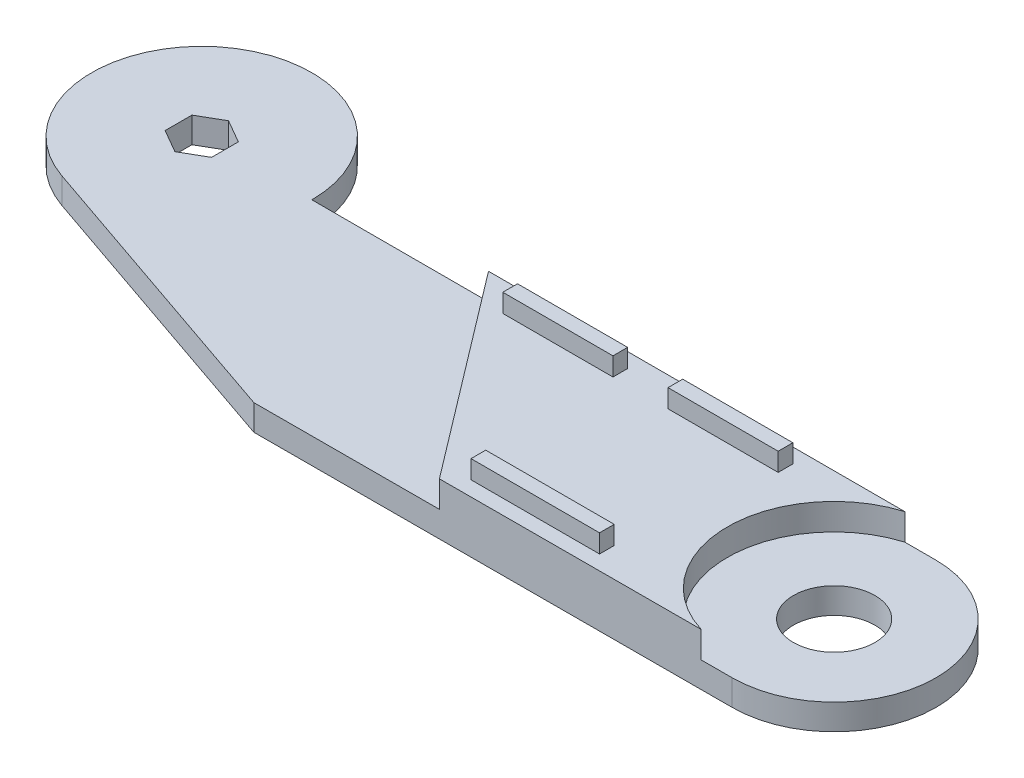
ISO-10303-21;
HEADER;
FILE_DESCRIPTION(('STEP AP214'),'2;1');
FILE_NAME('part.step','',(''),(''),'','','');
FILE_SCHEMA(('AUTOMOTIVE_DESIGN { 1 0 10303 214 1 1 1 1 }'));
ENDSEC;
DATA;
#1=APPLICATION_CONTEXT('core data for automotive mechanical design processes');
#2=APPLICATION_PROTOCOL_DEFINITION('international standard','automotive_design',2000,#1);
#3=PRODUCT_CONTEXT('',#1,'mechanical');
#4=PRODUCT('Part','Part','',(#3));
#5=PRODUCT_RELATED_PRODUCT_CATEGORY('part','',(#4));
#6=PRODUCT_DEFINITION_FORMATION('','',#4);
#7=PRODUCT_DEFINITION_CONTEXT('part definition',#1,'design');
#8=PRODUCT_DEFINITION('design','',#6,#7);
#9=PRODUCT_DEFINITION_SHAPE('','',#8);
#10=(LENGTH_UNIT() NAMED_UNIT(*) SI_UNIT(.MILLI.,.METRE.));
#11=(NAMED_UNIT(*) PLANE_ANGLE_UNIT() SI_UNIT($,.RADIAN.));
#12=(NAMED_UNIT(*) SI_UNIT($,.STERADIAN.) SOLID_ANGLE_UNIT());
#13=UNCERTAINTY_MEASURE_WITH_UNIT(LENGTH_MEASURE(1.E-05),#10,'distance_accuracy_value','');
#14=(GEOMETRIC_REPRESENTATION_CONTEXT(3) GLOBAL_UNCERTAINTY_ASSIGNED_CONTEXT((#13)) GLOBAL_UNIT_ASSIGNED_CONTEXT((#10,
#11,#12)) REPRESENTATION_CONTEXT('',''));
#15=CARTESIAN_POINT('',(0.,0.,0.));
#16=DIRECTION('',(0.,0.,1.));
#17=DIRECTION('',(1.,0.,0.));
#18=AXIS2_PLACEMENT_3D('',#15,#16,#17);
#19=CARTESIAN_POINT('',(0.,14.2,0.));
#20=DIRECTION('',(0.,1.,0.));
#21=DIRECTION('',(0.,0.,1.));
#22=AXIS2_PLACEMENT_3D('',#19,#20,#21);
#23=PLANE('',#22);
#24=DIRECTION('',(-0.604935888817992,0.,-0.796274180430325));
#25=VECTOR('',#24,1.);
#26=CARTESIAN_POINT('',(78.1003968083203,14.2,0.));
#27=LINE('',#26,#25);
#28=CARTESIAN_POINT('',(120.375042432172,14.2,55.6459112764647));
#29=VERTEX_POINT('',#28);
#30=CARTESIAN_POINT('',(78.1003968083203,14.2,0.));
#31=VERTEX_POINT('',#30);
#32=EDGE_CURVE('E240',#29,#31,#27,.T.);
#33=ORIENTED_EDGE('',*,*,#32,.F.);
#34=DIRECTION('',(0.999998314733049,0.,-0.0018359006134582));
#35=VECTOR('',#34,1.);
#36=CARTESIAN_POINT('',(0.102565918301086,14.2,55.8667199620002));
#37=LINE('',#36,#35);
#38=CARTESIAN_POINT('',(191.546705265924,14.2,55.5152469568031));
#39=VERTEX_POINT('',#38);
#40=EDGE_CURVE('E345',#29,#39,#37,.T.);
#41=ORIENTED_EDGE('',*,*,#40,.T.);
#42=CARTESIAN_POINT('',(199.918541878515,14.2,27.749938535464));
#43=DIRECTION('',(0.,1.,0.));
#44=DIRECTION('',(0.,0.,1.));
#45=AXIS2_PLACEMENT_3D('',#42,#43,#44);
#46=CIRCLE('',#45,29.);
#47=CARTESIAN_POINT('',(191.495899105729,14.2,0.));
#48=VERTEX_POINT('',#47);
#49=EDGE_CURVE('E340',#48,#39,#46,.T.);
#50=ORIENTED_EDGE('',*,*,#49,.F.);
#51=DIRECTION('',(-1.,0.,0.));
#52=VECTOR('',#51,1.);
#53=CARTESIAN_POINT('',(0.,14.2,0.));
#54=LINE('',#53,#52);
#55=EDGE_CURVE('E343',#48,#31,#54,.T.);
#56=ORIENTED_EDGE('',*,*,#55,.T.);
#57=EDGE_LOOP('',(#33,#41,#50,#56));
#58=FACE_BOUND('',#57,.T.);
#59=DIRECTION('',(1.,0.,0.));
#60=VECTOR('',#59,1.);
#61=CARTESIAN_POINT('',(90.,14.2,8.));
#62=LINE('',#61,#60);
#63=CARTESIAN_POINT('',(90.,14.2,8.));
#64=VERTEX_POINT('',#63);
#65=CARTESIAN_POINT('',(120.,14.2,8.));
#66=VERTEX_POINT('',#65);
#67=EDGE_CURVE('E318',#64,#66,#62,.T.);
#68=ORIENTED_EDGE('',*,*,#67,.F.);
#69=DIRECTION('',(0.,0.,1.));
#70=VECTOR('',#69,1.);
#71=CARTESIAN_POINT('',(90.,14.2,4.));
#72=LINE('',#71,#70);
#73=CARTESIAN_POINT('',(90.,14.2,4.));
#74=VERTEX_POINT('',#73);
#75=EDGE_CURVE('E304',#74,#64,#72,.T.);
#76=ORIENTED_EDGE('',*,*,#75,.F.);
#77=DIRECTION('',(-1.,0.,0.));
#78=VECTOR('',#77,1.);
#79=CARTESIAN_POINT('',(90.,14.2,4.));
#80=LINE('',#79,#78);
#81=CARTESIAN_POINT('',(120.,14.2,4.));
#82=VERTEX_POINT('',#81);
#83=EDGE_CURVE('E309',#82,#74,#80,.T.);
#84=ORIENTED_EDGE('',*,*,#83,.F.);
#85=DIRECTION('',(0.,0.,-1.));
#86=VECTOR('',#85,1.);
#87=CARTESIAN_POINT('',(120.,14.2,4.));
#88=LINE('',#87,#86);
#89=EDGE_CURVE('E320',#66,#82,#88,.T.);
#90=ORIENTED_EDGE('',*,*,#89,.F.);
#91=EDGE_LOOP('',(#68,#76,#84,#90));
#92=FACE_BOUND('',#91,.T.);
#93=DIRECTION('',(1.,0.,0.));
#94=VECTOR('',#93,1.);
#95=CARTESIAN_POINT('',(135.,14.2,8.00000000000002));
#96=LINE('',#95,#94);
#97=CARTESIAN_POINT('',(135.,14.2,8.00000000000002));
#98=VERTEX_POINT('',#97);
#99=CARTESIAN_POINT('',(165.,14.2,8.00000000000002));
#100=VERTEX_POINT('',#99);
#101=EDGE_CURVE('E291',#98,#100,#96,.T.);
#102=ORIENTED_EDGE('',*,*,#101,.F.);
#103=DIRECTION('',(0.,0.,1.));
#104=VECTOR('',#103,1.);
#105=CARTESIAN_POINT('',(135.,14.2,3.99999999999998));
#106=LINE('',#105,#104);
#107=CARTESIAN_POINT('',(135.,14.2,3.99999999999998));
#108=VERTEX_POINT('',#107);
#109=EDGE_CURVE('E277',#108,#98,#106,.T.);
#110=ORIENTED_EDGE('',*,*,#109,.F.);
#111=DIRECTION('',(-1.,0.,0.));
#112=VECTOR('',#111,1.);
#113=CARTESIAN_POINT('',(135.,14.2,3.99999999999998));
#114=LINE('',#113,#112);
#115=CARTESIAN_POINT('',(165.,14.2,3.99999999999998));
#116=VERTEX_POINT('',#115);
#117=EDGE_CURVE('E282',#116,#108,#114,.T.);
#118=ORIENTED_EDGE('',*,*,#117,.F.);
#119=DIRECTION('',(0.,0.,-1.));
#120=VECTOR('',#119,1.);
#121=CARTESIAN_POINT('',(165.,14.2,3.99999999999998));
#122=LINE('',#121,#120);
#123=EDGE_CURVE('E293',#100,#116,#122,.T.);
#124=ORIENTED_EDGE('',*,*,#123,.F.);
#125=EDGE_LOOP('',(#102,#110,#118,#124));
#126=FACE_BOUND('',#125,.T.);
#127=DIRECTION('',(1.,0.,0.));
#128=VECTOR('',#127,1.);
#129=CARTESIAN_POINT('',(124.92,14.2,51.573303801176));
#130=LINE('',#129,#128);
#131=CARTESIAN_POINT('',(124.92,14.2,51.573303801176));
#132=VERTEX_POINT('',#131);
#133=CARTESIAN_POINT('',(159.92,14.2,51.573303801176));
#134=VERTEX_POINT('',#133);
#135=EDGE_CURVE('E264',#132,#134,#130,.T.);
#136=ORIENTED_EDGE('',*,*,#135,.F.);
#137=DIRECTION('',(0.,0.,1.));
#138=VECTOR('',#137,1.);
#139=CARTESIAN_POINT('',(124.92,14.2,47.573303801176));
#140=LINE('',#139,#138);
#141=CARTESIAN_POINT('',(124.92,14.2,47.573303801176));
#142=VERTEX_POINT('',#141);
#143=EDGE_CURVE('E249',#142,#132,#140,.T.);
#144=ORIENTED_EDGE('',*,*,#143,.F.);
#145=DIRECTION('',(-1.,0.,0.));
#146=VECTOR('',#145,1.);
#147=CARTESIAN_POINT('',(124.92,14.2,47.573303801176));
#148=LINE('',#147,#146);
#149=CARTESIAN_POINT('',(159.92,14.2,47.573303801176));
#150=VERTEX_POINT('',#149);
#151=EDGE_CURVE('E255',#150,#142,#148,.T.);
#152=ORIENTED_EDGE('',*,*,#151,.F.);
#153=DIRECTION('',(0.,0.,-1.));
#154=VECTOR('',#153,1.);
#155=CARTESIAN_POINT('',(159.92,14.2,47.573303801176));
#156=LINE('',#155,#154);
#157=EDGE_CURVE('E266',#134,#150,#156,.T.);
#158=ORIENTED_EDGE('',*,*,#157,.F.);
#159=EDGE_LOOP('',(#136,#144,#152,#158));
#160=FACE_BOUND('',#159,.T.);
#161=ADVANCED_FACE('F35',(#58,#92,#126,#160),#23,.T.);
#162=CARTESIAN_POINT('',(0.,7.,0.));
#163=DIRECTION('',(0.,1.,0.));
#164=DIRECTION('',(0.,0.,1.));
#165=AXIS2_PLACEMENT_3D('',#162,#163,#164);
#166=PLANE('',#165);
#167=CARTESIAN_POINT('',(200.,7.,27.75));
#168=DIRECTION('',(0.,1.,0.));
#169=DIRECTION('',(0.,0.,1.));
#170=AXIS2_PLACEMENT_3D('',#167,#168,#169);
#171=CIRCLE('',#170,11.1);
#172=CARTESIAN_POINT('',(200.,7.,38.85));
#173=VERTEX_POINT('',#172);
#174=EDGE_CURVE('E336',#173,#173,#171,.T.);
#175=ORIENTED_EDGE('',*,*,#174,.F.);
#176=EDGE_LOOP('',(#175));
#177=FACE_BOUND('',#176,.T.);
#178=DIRECTION('',(-1.,0.,0.));
#179=VECTOR('',#178,1.);
#180=CARTESIAN_POINT('',(0.,7.,0.));
#181=LINE('',#180,#179);
#182=CARTESIAN_POINT('',(199.917837119483,7.,0.));
#183=VERTEX_POINT('',#182);
#184=CARTESIAN_POINT('',(191.495899105729,7.,0.));
#185=VERTEX_POINT('',#184);
#186=EDGE_CURVE('E231',#183,#185,#181,.T.);
#187=ORIENTED_EDGE('',*,*,#186,.T.);
#188=CARTESIAN_POINT('',(199.918541878515,7.,27.749938535464));
#189=DIRECTION('',(0.,1.,0.));
#190=DIRECTION('',(0.,0.,1.));
#191=AXIS2_PLACEMENT_3D('',#188,#189,#190);
#192=CIRCLE('',#191,29.);
#193=CARTESIAN_POINT('',(191.546705265924,7.,55.5152469568031));
#194=VERTEX_POINT('',#193);
#195=EDGE_CURVE('E339',#185,#194,#192,.T.);
#196=ORIENTED_EDGE('',*,*,#195,.T.);
#197=DIRECTION('',(-0.999998314733049,0.,0.0018359006134582));
#198=VECTOR('',#197,1.);
#199=CARTESIAN_POINT('',(0.102565918301086,7.,55.8667199620002));
#200=LINE('',#199,#198);
#201=CARTESIAN_POINT('',(199.917837119483,7.,55.4998783647976));
#202=VERTEX_POINT('',#201);
#203=EDGE_CURVE('E403',#202,#194,#200,.T.);
#204=ORIENTED_EDGE('',*,*,#203,.F.);
#205=CARTESIAN_POINT('',(200.,7.,27.75));
#206=DIRECTION('',(0.,1.,0.));
#207=DIRECTION('',(0.,0.,1.));
#208=AXIS2_PLACEMENT_3D('',#205,#206,#207);
#209=CIRCLE('',#208,27.75);
#210=CARTESIAN_POINT('',(199.917837119483,7.,0.000121635202365161));
#211=VERTEX_POINT('',#210);
#212=EDGE_CURVE('E406',#211,#202,#209,.F.);
#213=ORIENTED_EDGE('',*,*,#212,.F.);
#214=DIRECTION('',(0.,0.,-1.));
#215=VECTOR('',#214,1.);
#216=CARTESIAN_POINT('',(199.917837119483,7.,0.));
#217=LINE('',#216,#215);
#218=EDGE_CURVE('E409',#211,#183,#217,.T.);
#219=ORIENTED_EDGE('',*,*,#218,.T.);
#220=EDGE_LOOP('',(#187,#196,#204,#213,#219));
#221=FACE_BOUND('',#220,.T.);
#222=ADVANCED_FACE('F459',(#177,#221),#166,.T.);
#223=DIRECTION('',(0.866025403784439,0.,-0.5));
#224=VECTOR('',#223,1.);
#225=CARTESIAN_POINT('',(3.1609927238132,7.,5.475));
#226=LINE('',#225,#224);
#227=CARTESIAN_POINT('',(0.,7.,7.3));
#228=VERTEX_POINT('',#227);
#229=CARTESIAN_POINT('',(6.3219854476264,7.,3.65));
#230=VERTEX_POINT('',#229);
#231=EDGE_CURVE('E394',#228,#230,#226,.T.);
#232=ORIENTED_EDGE('',*,*,#231,.F.);
#233=DIRECTION('',(0.866025403784439,0.,0.5));
#234=VECTOR('',#233,1.);
#235=CARTESIAN_POINT('',(-3.1609927238132,7.,5.475));
#236=LINE('',#235,#234);
#237=CARTESIAN_POINT('',(-6.3219854476264,7.,3.65));
#238=VERTEX_POINT('',#237);
#239=EDGE_CURVE('E373',#238,#228,#236,.T.);
#240=ORIENTED_EDGE('',*,*,#239,.F.);
#241=DIRECTION('',(0.,0.,1.));
#242=VECTOR('',#241,1.);
#243=CARTESIAN_POINT('',(-6.3219854476264,7.,0.));
#244=LINE('',#243,#242);
#245=CARTESIAN_POINT('',(-6.3219854476264,7.,-3.65));
#246=VERTEX_POINT('',#245);
#247=EDGE_CURVE('E385',#246,#238,#244,.T.);
#248=ORIENTED_EDGE('',*,*,#247,.F.);
#249=DIRECTION('',(-0.866025403784439,0.,0.5));
#250=VECTOR('',#249,1.);
#251=CARTESIAN_POINT('',(-3.1609927238132,7.,-5.475));
#252=LINE('',#251,#250);
#253=CARTESIAN_POINT('',(0.,7.,-7.3));
#254=VERTEX_POINT('',#253);
#255=EDGE_CURVE('E388',#254,#246,#252,.T.);
#256=ORIENTED_EDGE('',*,*,#255,.F.);
#257=DIRECTION('',(-0.866025403784439,0.,-0.5));
#258=VECTOR('',#257,1.);
#259=CARTESIAN_POINT('',(3.1609927238132,7.,-5.475));
#260=LINE('',#259,#258);
#261=CARTESIAN_POINT('',(6.3219854476264,7.,-3.65));
#262=VERTEX_POINT('',#261);
#263=EDGE_CURVE('E390',#262,#254,#260,.T.);
#264=ORIENTED_EDGE('',*,*,#263,.F.);
#265=DIRECTION('',(0.,0.,-1.));
#266=VECTOR('',#265,1.);
#267=CARTESIAN_POINT('',(6.3219854476264,7.,0.));
#268=LINE('',#267,#266);
#269=EDGE_CURVE('E392',#230,#262,#268,.T.);
#270=ORIENTED_EDGE('',*,*,#269,.F.);
#271=EDGE_LOOP('',(#232,#240,#248,#256,#264,#270));
#272=FACE_BOUND('',#271,.T.);
#273=CARTESIAN_POINT('',(120.375042432172,7.,55.6459112764647));
#274=VERTEX_POINT('',#273);
#275=CARTESIAN_POINT('',(69.9180562041865,7.,55.7385454445472));
#276=VERTEX_POINT('',#275);
#277=EDGE_CURVE('E245',#274,#276,#200,.T.);
#278=ORIENTED_EDGE('',*,*,#277,.F.);
#279=DIRECTION('',(-0.604935888817992,0.,-0.796274180430325));
#280=VECTOR('',#279,1.);
#281=CARTESIAN_POINT('',(78.1003968083203,7.,0.));
#282=LINE('',#281,#280);
#283=CARTESIAN_POINT('',(78.1003968083203,7.,0.));
#284=VERTEX_POINT('',#283);
#285=EDGE_CURVE('E237',#274,#284,#282,.T.);
#286=ORIENTED_EDGE('',*,*,#285,.T.);
#287=CARTESIAN_POINT('',(30.,7.,0.));
#288=VERTEX_POINT('',#287);
#289=EDGE_CURVE('E222',#284,#288,#181,.T.);
#290=ORIENTED_EDGE('',*,*,#289,.T.);
#291=CARTESIAN_POINT('',(0.,7.,0.));
#292=DIRECTION('',(0.,1.,0.));
#293=DIRECTION('',(0.,0.,1.));
#294=AXIS2_PLACEMENT_3D('',#291,#292,#293);
#295=CIRCLE('',#294,30.);
#296=CARTESIAN_POINT('',(-9.7464147083776,7.,28.3726523316436));
#297=VERTEX_POINT('',#296);
#298=EDGE_CURVE('E398',#288,#297,#295,.T.);
#299=ORIENTED_EDGE('',*,*,#298,.T.);
#300=DIRECTION('',(-0.945755077721453,0.,-0.324880490279253));
#301=VECTOR('',#300,1.);
#302=CARTESIAN_POINT('',(-9.7464147083776,7.,28.3726523316436));
#303=LINE('',#302,#301);
#304=EDGE_CURVE('E400',#276,#297,#303,.T.);
#305=ORIENTED_EDGE('',*,*,#304,.F.);
#306=EDGE_LOOP('',(#278,#286,#290,#299,#305));
#307=FACE_BOUND('',#306,.T.);
#308=ADVANCED_FACE('F243',(#272,#307),#166,.T.);
#309=CARTESIAN_POINT('',(0.,7.,0.));
#310=DIRECTION('',(0.,0.,1.));
#311=DIRECTION('',(1.,0.,0.));
#312=AXIS2_PLACEMENT_3D('',#309,#310,#311);
#313=PLANE('',#312);
#314=ORIENTED_EDGE('',*,*,#289,.F.);
#315=DIRECTION('',(0.,1.,0.));
#316=VECTOR('',#315,1.);
#317=CARTESIAN_POINT('',(78.1003968083203,7.,0.));
#318=LINE('',#317,#316);
#319=EDGE_CURVE('E225',#284,#31,#318,.T.);
#320=ORIENTED_EDGE('',*,*,#319,.T.);
#321=ORIENTED_EDGE('',*,*,#55,.F.);
#322=DIRECTION('',(0.,-1.,0.));
#323=VECTOR('',#322,1.);
#324=CARTESIAN_POINT('',(191.495899105729,14.2,0.));
#325=LINE('',#324,#323);
#326=EDGE_CURVE('E351',#48,#185,#325,.T.);
#327=ORIENTED_EDGE('',*,*,#326,.T.);
#328=ORIENTED_EDGE('',*,*,#186,.F.);
#329=DIRECTION('',(0.,-1.,0.));
#330=VECTOR('',#329,1.);
#331=CARTESIAN_POINT('',(199.917837119483,7.,0.));
#332=LINE('',#331,#330);
#333=CARTESIAN_POINT('',(199.917837119483,0.,0.));
#334=VERTEX_POINT('',#333);
#335=EDGE_CURVE('E411',#183,#334,#332,.T.);
#336=ORIENTED_EDGE('',*,*,#335,.T.);
#337=DIRECTION('',(-1.,0.,0.));
#338=VECTOR('',#337,1.);
#339=CARTESIAN_POINT('',(0.,0.,0.));
#340=LINE('',#339,#338);
#341=CARTESIAN_POINT('',(30.,0.,0.));
#342=VERTEX_POINT('',#341);
#343=EDGE_CURVE('E395',#334,#342,#340,.T.);
#344=ORIENTED_EDGE('',*,*,#343,.T.);
#345=DIRECTION('',(0.,-1.,0.));
#346=VECTOR('',#345,1.);
#347=CARTESIAN_POINT('',(30.,7.,0.));
#348=LINE('',#347,#346);
#349=EDGE_CURVE('E11',#288,#342,#348,.T.);
#350=ORIENTED_EDGE('',*,*,#349,.F.);
#351=EDGE_LOOP('',(#314,#320,#321,#327,#328,#336,#344,#350));
#352=FACE_BOUND('',#351,.T.);
#353=ADVANCED_FACE('F37',(#352),#313,.F.);
#354=CARTESIAN_POINT('',(0.,7.,0.));
#355=DIRECTION('',(0.,-1.,0.));
#356=DIRECTION('',(0.,0.,-1.));
#357=AXIS2_PLACEMENT_3D('',#354,#355,#356);
#358=CYLINDRICAL_SURFACE('',#357,30.);
#359=CARTESIAN_POINT('',(0.,0.,0.));
#360=DIRECTION('',(0.,1.,0.));
#361=DIRECTION('',(0.,0.,1.));
#362=AXIS2_PLACEMENT_3D('',#359,#360,#361);
#363=CIRCLE('',#362,30.);
#364=CARTESIAN_POINT('',(-9.7464147083776,0.,28.3726523316436));
#365=VERTEX_POINT('',#364);
#366=EDGE_CURVE('E413',#342,#365,#363,.T.);
#367=ORIENTED_EDGE('',*,*,#366,.T.);
#368=DIRECTION('',(0.,-1.,0.));
#369=VECTOR('',#368,1.);
#370=CARTESIAN_POINT('',(-9.7464147083776,7.,28.3726523316436));
#371=LINE('',#370,#369);
#372=EDGE_CURVE('E43',#297,#365,#371,.T.);
#373=ORIENTED_EDGE('',*,*,#372,.F.);
#374=ORIENTED_EDGE('',*,*,#298,.F.);
#375=ORIENTED_EDGE('',*,*,#349,.T.);
#376=EDGE_LOOP('',(#367,#373,#374,#375));
#377=FACE_BOUND('',#376,.T.);
#378=ADVANCED_FACE('F439',(#377),#358,.T.);
#379=CARTESIAN_POINT('',(-9.7464147083776,7.,28.3726523316436));
#380=DIRECTION('',(-0.324880490279253,0.,0.945755077721453));
#381=DIRECTION('',(0.945755077721453,0.,0.324880490279253));
#382=AXIS2_PLACEMENT_3D('',#379,#380,#381);
#383=PLANE('',#382);
#384=DIRECTION('',(-0.945755077721453,0.,-0.324880490279253));
#385=VECTOR('',#384,1.);
#386=CARTESIAN_POINT('',(-9.7464147083776,0.,28.3726523316436));
#387=LINE('',#386,#385);
#388=CARTESIAN_POINT('',(69.9180562041865,0.,55.7385454445472));
#389=VERTEX_POINT('',#388);
#390=EDGE_CURVE('E416',#389,#365,#387,.T.);
#391=ORIENTED_EDGE('',*,*,#390,.F.);
#392=DIRECTION('',(0.,-1.,0.));
#393=VECTOR('',#392,1.);
#394=CARTESIAN_POINT('',(69.9180562041865,7.,55.7385454445472));
#395=LINE('',#394,#393);
#396=EDGE_CURVE('E432',#276,#389,#395,.T.);
#397=ORIENTED_EDGE('',*,*,#396,.F.);
#398=ORIENTED_EDGE('',*,*,#304,.T.);
#399=ORIENTED_EDGE('',*,*,#372,.T.);
#400=EDGE_LOOP('',(#391,#397,#398,#399));
#401=FACE_BOUND('',#400,.T.);
#402=ADVANCED_FACE('F436',(#401),#383,.T.);
#403=CARTESIAN_POINT('',(0.102565918301086,7.,55.8667199620002));
#404=DIRECTION('',(0.0018359006134582,0.,0.999998314733049));
#405=DIRECTION('',(0.999998314733049,0.,-0.0018359006134582));
#406=AXIS2_PLACEMENT_3D('',#403,#404,#405);
#407=PLANE('',#406);
#408=DIRECTION('',(0.,1.,0.));
#409=VECTOR('',#408,1.);
#410=CARTESIAN_POINT('',(120.375042432172,7.,55.6459112764647));
#411=LINE('',#410,#409);
#412=EDGE_CURVE('E241',#274,#29,#411,.T.);
#413=ORIENTED_EDGE('',*,*,#412,.F.);
#414=ORIENTED_EDGE('',*,*,#277,.T.);
#415=ORIENTED_EDGE('',*,*,#396,.T.);
#416=DIRECTION('',(-0.999998314733049,0.,0.0018359006134582));
#417=VECTOR('',#416,1.);
#418=CARTESIAN_POINT('',(0.102565918301086,0.,55.8667199620002));
#419=LINE('',#418,#417);
#420=CARTESIAN_POINT('',(199.917837119483,0.,55.4998783647976));
#421=VERTEX_POINT('',#420);
#422=EDGE_CURVE('E419',#421,#389,#419,.T.);
#423=ORIENTED_EDGE('',*,*,#422,.F.);
#424=DIRECTION('',(0.,-1.,0.));
#425=VECTOR('',#424,1.);
#426=CARTESIAN_POINT('',(199.917837119483,7.,55.4998783647976));
#427=LINE('',#426,#425);
#428=EDGE_CURVE('E430',#202,#421,#427,.T.);
#429=ORIENTED_EDGE('',*,*,#428,.F.);
#430=ORIENTED_EDGE('',*,*,#203,.T.);
#431=DIRECTION('',(0.,-1.,0.));
#432=VECTOR('',#431,1.);
#433=CARTESIAN_POINT('',(191.546705265924,14.2,55.5152469568031));
#434=LINE('',#433,#432);
#435=EDGE_CURVE('E347',#39,#194,#434,.T.);
#436=ORIENTED_EDGE('',*,*,#435,.F.);
#437=ORIENTED_EDGE('',*,*,#40,.F.);
#438=EDGE_LOOP('',(#413,#414,#415,#423,#429,#430,#436,#437));
#439=FACE_BOUND('',#438,.T.);
#440=ADVANCED_FACE('F447',(#439),#407,.T.);
#441=CARTESIAN_POINT('',(200.,7.,27.75));
#442=DIRECTION('',(0.,-1.,0.));
#443=DIRECTION('',(0.,0.,-1.));
#444=AXIS2_PLACEMENT_3D('',#441,#442,#443);
#445=CYLINDRICAL_SURFACE('',#444,27.75);
#446=CARTESIAN_POINT('',(200.,0.,27.75));
#447=DIRECTION('',(0.,1.,0.));
#448=DIRECTION('',(0.,0.,1.));
#449=AXIS2_PLACEMENT_3D('',#446,#447,#448);
#450=CIRCLE('',#449,27.75);
#451=CARTESIAN_POINT('',(199.917837119483,0.,0.000121635202365161));
#452=VERTEX_POINT('',#451);
#453=EDGE_CURVE('E422',#452,#421,#450,.F.);
#454=ORIENTED_EDGE('',*,*,#453,.F.);
#455=DIRECTION('',(0.,-1.,0.));
#456=VECTOR('',#455,1.);
#457=CARTESIAN_POINT('',(199.917837119483,7.,0.000121635202365161));
#458=LINE('',#457,#456);
#459=EDGE_CURVE('E428',#211,#452,#458,.T.);
#460=ORIENTED_EDGE('',*,*,#459,.F.);
#461=ORIENTED_EDGE('',*,*,#212,.T.);
#462=ORIENTED_EDGE('',*,*,#428,.T.);
#463=EDGE_LOOP('',(#454,#460,#461,#462));
#464=FACE_BOUND('',#463,.T.);
#465=ADVANCED_FACE('F466',(#464),#445,.T.);
#466=CARTESIAN_POINT('',(199.917837119483,7.,0.));
#467=DIRECTION('',(-1.,0.,0.));
#468=DIRECTION('',(0.,0.,1.));
#469=AXIS2_PLACEMENT_3D('',#466,#467,#468);
#470=PLANE('',#469);
#471=DIRECTION('',(0.,0.,-1.));
#472=VECTOR('',#471,1.);
#473=CARTESIAN_POINT('',(199.917837119483,0.,0.));
#474=LINE('',#473,#472);
#475=EDGE_CURVE('E232',#452,#334,#474,.T.);
#476=ORIENTED_EDGE('',*,*,#475,.T.);
#477=ORIENTED_EDGE('',*,*,#335,.F.);
#478=ORIENTED_EDGE('',*,*,#218,.F.);
#479=ORIENTED_EDGE('',*,*,#459,.T.);
#480=EDGE_LOOP('',(#476,#477,#478,#479));
#481=FACE_BOUND('',#480,.T.);
#482=ADVANCED_FACE('F464',(#481),#470,.F.);
#483=CARTESIAN_POINT('',(0.,0.,0.));
#484=DIRECTION('',(0.,1.,0.));
#485=DIRECTION('',(0.,0.,1.));
#486=AXIS2_PLACEMENT_3D('',#483,#484,#485);
#487=PLANE('',#486);
#488=CARTESIAN_POINT('',(200.,0.,27.75));
#489=DIRECTION('',(0.,-1.,0.));
#490=DIRECTION('',(0.,0.,-1.));
#491=AXIS2_PLACEMENT_3D('',#488,#489,#490);
#492=CIRCLE('',#491,11.1);
#493=CARTESIAN_POINT('',(200.,0.,16.65));
#494=VERTEX_POINT('',#493);
#495=EDGE_CURVE('E333',#494,#494,#492,.T.);
#496=ORIENTED_EDGE('',*,*,#495,.F.);
#497=EDGE_LOOP('',(#496));
#498=FACE_BOUND('',#497,.T.);
#499=DIRECTION('',(-0.866025403784439,0.,-0.5));
#500=VECTOR('',#499,1.);
#501=CARTESIAN_POINT('',(0.,0.,7.3));
#502=LINE('',#501,#500);
#503=CARTESIAN_POINT('',(0.,0.,7.3));
#504=VERTEX_POINT('',#503);
#505=CARTESIAN_POINT('',(-6.3219854476264,0.,3.65));
#506=VERTEX_POINT('',#505);
#507=EDGE_CURVE('E355',#504,#506,#502,.T.);
#508=ORIENTED_EDGE('',*,*,#507,.F.);
#509=DIRECTION('',(-0.866025403784439,0.,0.5));
#510=VECTOR('',#509,1.);
#511=CARTESIAN_POINT('',(6.3219854476264,0.,3.65));
#512=LINE('',#511,#510);
#513=CARTESIAN_POINT('',(6.3219854476264,0.,3.65));
#514=VERTEX_POINT('',#513);
#515=EDGE_CURVE('E353',#514,#504,#512,.T.);
#516=ORIENTED_EDGE('',*,*,#515,.F.);
#517=DIRECTION('',(0.,0.,1.));
#518=VECTOR('',#517,1.);
#519=CARTESIAN_POINT('',(6.3219854476264,0.,-3.65));
#520=LINE('',#519,#518);
#521=CARTESIAN_POINT('',(6.3219854476264,0.,-3.65));
#522=VERTEX_POINT('',#521);
#523=EDGE_CURVE('E367',#522,#514,#520,.T.);
#524=ORIENTED_EDGE('',*,*,#523,.F.);
#525=DIRECTION('',(0.866025403784439,0.,0.5));
#526=VECTOR('',#525,1.);
#527=CARTESIAN_POINT('',(0.,0.,-7.3));
#528=LINE('',#527,#526);
#529=CARTESIAN_POINT('',(0.,0.,-7.3));
#530=VERTEX_POINT('',#529);
#531=EDGE_CURVE('E364',#530,#522,#528,.T.);
#532=ORIENTED_EDGE('',*,*,#531,.F.);
#533=DIRECTION('',(0.866025403784439,0.,-0.5));
#534=VECTOR('',#533,1.);
#535=CARTESIAN_POINT('',(-6.3219854476264,0.,-3.65));
#536=LINE('',#535,#534);
#537=CARTESIAN_POINT('',(-6.3219854476264,0.,-3.65));
#538=VERTEX_POINT('',#537);
#539=EDGE_CURVE('E361',#538,#530,#536,.T.);
#540=ORIENTED_EDGE('',*,*,#539,.F.);
#541=DIRECTION('',(0.,0.,-1.));
#542=VECTOR('',#541,1.);
#543=CARTESIAN_POINT('',(-6.3219854476264,0.,3.65));
#544=LINE('',#543,#542);
#545=EDGE_CURVE('E358',#506,#538,#544,.T.);
#546=ORIENTED_EDGE('',*,*,#545,.F.);
#547=EDGE_LOOP('',(#508,#516,#524,#532,#540,#546));
#548=FACE_BOUND('',#547,.T.);
#549=ORIENTED_EDGE('',*,*,#343,.F.);
#550=ORIENTED_EDGE('',*,*,#475,.F.);
#551=ORIENTED_EDGE('',*,*,#453,.T.);
#552=ORIENTED_EDGE('',*,*,#422,.T.);
#553=ORIENTED_EDGE('',*,*,#390,.T.);
#554=ORIENTED_EDGE('',*,*,#366,.F.);
#555=EDGE_LOOP('',(#549,#550,#551,#552,#553,#554));
#556=FACE_BOUND('',#555,.T.);
#557=ADVANCED_FACE('F442',(#498,#548,#556),#487,.F.);
#558=CARTESIAN_POINT('',(6.3219854476264,9.,3.65));
#559=DIRECTION('',(0.5,0.,0.866025403784439));
#560=DIRECTION('',(0.866025403784439,0.,-0.5));
#561=AXIS2_PLACEMENT_3D('',#558,#559,#560);
#562=PLANE('',#561);
#563=ORIENTED_EDGE('',*,*,#231,.T.);
#564=DIRECTION('',(0.,-1.,0.));
#565=VECTOR('',#564,1.);
#566=CARTESIAN_POINT('',(6.3219854476264,9.,3.65));
#567=LINE('',#566,#565);
#568=EDGE_CURVE('E371',#230,#514,#567,.T.);
#569=ORIENTED_EDGE('',*,*,#568,.T.);
#570=ORIENTED_EDGE('',*,*,#515,.T.);
#571=DIRECTION('',(0.,-1.,0.));
#572=VECTOR('',#571,1.);
#573=CARTESIAN_POINT('',(0.,9.,7.3));
#574=LINE('',#573,#572);
#575=EDGE_CURVE('E370',#228,#504,#574,.T.);
#576=ORIENTED_EDGE('',*,*,#575,.F.);
#577=EDGE_LOOP('',(#563,#569,#570,#576));
#578=FACE_BOUND('',#577,.T.);
#579=ADVANCED_FACE('F493',(#578),#562,.F.);
#580=CARTESIAN_POINT('',(6.3219854476264,9.,-3.65));
#581=DIRECTION('',(1.,0.,0.));
#582=DIRECTION('',(0.,0.,-1.));
#583=AXIS2_PLACEMENT_3D('',#580,#581,#582);
#584=PLANE('',#583);
#585=ORIENTED_EDGE('',*,*,#269,.T.);
#586=DIRECTION('',(0.,-1.,0.));
#587=VECTOR('',#586,1.);
#588=CARTESIAN_POINT('',(6.3219854476264,9.,-3.65));
#589=LINE('',#588,#587);
#590=EDGE_CURVE('E374',#262,#522,#589,.T.);
#591=ORIENTED_EDGE('',*,*,#590,.T.);
#592=ORIENTED_EDGE('',*,*,#523,.T.);
#593=ORIENTED_EDGE('',*,*,#568,.F.);
#594=EDGE_LOOP('',(#585,#591,#592,#593));
#595=FACE_BOUND('',#594,.T.);
#596=ADVANCED_FACE('F489',(#595),#584,.F.);
#597=CARTESIAN_POINT('',(0.,9.,-7.3));
#598=DIRECTION('',(0.5,0.,-0.866025403784439));
#599=DIRECTION('',(-0.866025403784439,0.,-0.5));
#600=AXIS2_PLACEMENT_3D('',#597,#598,#599);
#601=PLANE('',#600);
#602=ORIENTED_EDGE('',*,*,#263,.T.);
#603=DIRECTION('',(0.,-1.,0.));
#604=VECTOR('',#603,1.);
#605=CARTESIAN_POINT('',(0.,9.,-7.3));
#606=LINE('',#605,#604);
#607=EDGE_CURVE('E376',#254,#530,#606,.T.);
#608=ORIENTED_EDGE('',*,*,#607,.T.);
#609=ORIENTED_EDGE('',*,*,#531,.T.);
#610=ORIENTED_EDGE('',*,*,#590,.F.);
#611=EDGE_LOOP('',(#602,#608,#609,#610));
#612=FACE_BOUND('',#611,.T.);
#613=ADVANCED_FACE('F492',(#612),#601,.F.);
#614=CARTESIAN_POINT('',(-6.3219854476264,9.,-3.65));
#615=DIRECTION('',(-0.5,0.,-0.866025403784439));
#616=DIRECTION('',(-0.866025403784439,0.,0.5));
#617=AXIS2_PLACEMENT_3D('',#614,#615,#616);
#618=PLANE('',#617);
#619=ORIENTED_EDGE('',*,*,#255,.T.);
#620=DIRECTION('',(0.,-1.,0.));
#621=VECTOR('',#620,1.);
#622=CARTESIAN_POINT('',(-6.3219854476264,9.,-3.65));
#623=LINE('',#622,#621);
#624=EDGE_CURVE('E378',#246,#538,#623,.T.);
#625=ORIENTED_EDGE('',*,*,#624,.T.);
#626=ORIENTED_EDGE('',*,*,#539,.T.);
#627=ORIENTED_EDGE('',*,*,#607,.F.);
#628=EDGE_LOOP('',(#619,#625,#626,#627));
#629=FACE_BOUND('',#628,.T.);
#630=ADVANCED_FACE('F497',(#629),#618,.F.);
#631=CARTESIAN_POINT('',(-6.3219854476264,9.,3.65));
#632=DIRECTION('',(-1.,0.,0.));
#633=DIRECTION('',(0.,0.,1.));
#634=AXIS2_PLACEMENT_3D('',#631,#632,#633);
#635=PLANE('',#634);
#636=ORIENTED_EDGE('',*,*,#247,.T.);
#637=DIRECTION('',(0.,-1.,0.));
#638=VECTOR('',#637,1.);
#639=CARTESIAN_POINT('',(-6.3219854476264,9.,3.65));
#640=LINE('',#639,#638);
#641=EDGE_CURVE('E380',#238,#506,#640,.T.);
#642=ORIENTED_EDGE('',*,*,#641,.T.);
#643=ORIENTED_EDGE('',*,*,#545,.T.);
#644=ORIENTED_EDGE('',*,*,#624,.F.);
#645=EDGE_LOOP('',(#636,#642,#643,#644));
#646=FACE_BOUND('',#645,.T.);
#647=ADVANCED_FACE('F501',(#646),#635,.F.);
#648=CARTESIAN_POINT('',(0.,9.,7.3));
#649=DIRECTION('',(-0.5,0.,0.866025403784439));
#650=DIRECTION('',(0.866025403784439,0.,0.5));
#651=AXIS2_PLACEMENT_3D('',#648,#649,#650);
#652=PLANE('',#651);
#653=ORIENTED_EDGE('',*,*,#239,.T.);
#654=ORIENTED_EDGE('',*,*,#575,.T.);
#655=ORIENTED_EDGE('',*,*,#507,.T.);
#656=ORIENTED_EDGE('',*,*,#641,.F.);
#657=EDGE_LOOP('',(#653,#654,#655,#656));
#658=FACE_BOUND('',#657,.T.);
#659=ADVANCED_FACE('F488',(#658),#652,.F.);
#660=CARTESIAN_POINT('',(199.918541878515,14.2,27.749938535464));
#661=DIRECTION('',(0.,-1.,0.));
#662=DIRECTION('',(0.,0.,-1.));
#663=AXIS2_PLACEMENT_3D('',#660,#661,#662);
#664=CYLINDRICAL_SURFACE('',#663,29.);
#665=ORIENTED_EDGE('',*,*,#195,.F.);
#666=ORIENTED_EDGE('',*,*,#326,.F.);
#667=ORIENTED_EDGE('',*,*,#49,.T.);
#668=ORIENTED_EDGE('',*,*,#435,.T.);
#669=EDGE_LOOP('',(#665,#666,#667,#668));
#670=FACE_BOUND('',#669,.T.);
#671=ADVANCED_FACE('F457',(#670),#664,.F.);
#672=CARTESIAN_POINT('',(200.,14.2,27.75));
#673=DIRECTION('',(0.,-1.,0.));
#674=DIRECTION('',(0.,0.,-1.));
#675=AXIS2_PLACEMENT_3D('',#672,#673,#674);
#676=CYLINDRICAL_SURFACE('',#675,11.1);
#677=ORIENTED_EDGE('',*,*,#174,.T.);
#678=EDGE_LOOP('',(#677));
#679=FACE_BOUND('',#678,.T.);
#680=ORIENTED_EDGE('',*,*,#495,.T.);
#681=EDGE_LOOP('',(#680));
#682=FACE_BOUND('',#681,.T.);
#683=ADVANCED_FACE('F484',(#679,#682),#676,.F.);
#684=CARTESIAN_POINT('',(90.,19.2,4.));
#685=DIRECTION('',(1.,0.,0.));
#686=DIRECTION('',(0.,0.,-1.));
#687=AXIS2_PLACEMENT_3D('',#684,#685,#686);
#688=PLANE('',#687);
#689=ORIENTED_EDGE('',*,*,#75,.T.);
#690=DIRECTION('',(0.,-1.,0.));
#691=VECTOR('',#690,1.);
#692=CARTESIAN_POINT('',(90.,19.2,8.));
#693=LINE('',#692,#691);
#694=CARTESIAN_POINT('',(90.,19.2,8.));
#695=VERTEX_POINT('',#694);
#696=EDGE_CURVE('E331',#695,#64,#693,.T.);
#697=ORIENTED_EDGE('',*,*,#696,.F.);
#698=DIRECTION('',(0.,0.,1.));
#699=VECTOR('',#698,1.);
#700=CARTESIAN_POINT('',(90.,19.2,4.));
#701=LINE('',#700,#699);
#702=CARTESIAN_POINT('',(90.,19.2,4.));
#703=VERTEX_POINT('',#702);
#704=EDGE_CURVE('E305',#703,#695,#701,.T.);
#705=ORIENTED_EDGE('',*,*,#704,.F.);
#706=DIRECTION('',(0.,-1.,0.));
#707=VECTOR('',#706,1.);
#708=CARTESIAN_POINT('',(90.,19.2,4.));
#709=LINE('',#708,#707);
#710=EDGE_CURVE('E315',#703,#74,#709,.T.);
#711=ORIENTED_EDGE('',*,*,#710,.T.);
#712=EDGE_LOOP('',(#689,#697,#705,#711));
#713=FACE_BOUND('',#712,.T.);
#714=ADVANCED_FACE('F677',(#713),#688,.F.);
#715=CARTESIAN_POINT('',(90.,19.2,8.));
#716=DIRECTION('',(0.,0.,-1.));
#717=DIRECTION('',(-1.,0.,0.));
#718=AXIS2_PLACEMENT_3D('',#715,#716,#717);
#719=PLANE('',#718);
#720=ORIENTED_EDGE('',*,*,#67,.T.);
#721=DIRECTION('',(0.,-1.,0.));
#722=VECTOR('',#721,1.);
#723=CARTESIAN_POINT('',(120.,19.2,8.));
#724=LINE('',#723,#722);
#725=CARTESIAN_POINT('',(120.,19.2,8.));
#726=VERTEX_POINT('',#725);
#727=EDGE_CURVE('E328',#726,#66,#724,.T.);
#728=ORIENTED_EDGE('',*,*,#727,.F.);
#729=DIRECTION('',(1.,0.,0.));
#730=VECTOR('',#729,1.);
#731=CARTESIAN_POINT('',(90.,19.2,8.));
#732=LINE('',#731,#730);
#733=EDGE_CURVE('E308',#695,#726,#732,.T.);
#734=ORIENTED_EDGE('',*,*,#733,.F.);
#735=ORIENTED_EDGE('',*,*,#696,.T.);
#736=EDGE_LOOP('',(#720,#728,#734,#735));
#737=FACE_BOUND('',#736,.T.);
#738=ADVANCED_FACE('F669',(#737),#719,.F.);
#739=CARTESIAN_POINT('',(120.,19.2,4.));
#740=DIRECTION('',(-1.,0.,0.));
#741=DIRECTION('',(0.,0.,1.));
#742=AXIS2_PLACEMENT_3D('',#739,#740,#741);
#743=PLANE('',#742);
#744=ORIENTED_EDGE('',*,*,#89,.T.);
#745=DIRECTION('',(0.,-1.,0.));
#746=VECTOR('',#745,1.);
#747=CARTESIAN_POINT('',(120.,19.2,4.));
#748=LINE('',#747,#746);
#749=CARTESIAN_POINT('',(120.,19.2,4.));
#750=VERTEX_POINT('',#749);
#751=EDGE_CURVE('E326',#750,#82,#748,.T.);
#752=ORIENTED_EDGE('',*,*,#751,.F.);
#753=DIRECTION('',(0.,0.,-1.));
#754=VECTOR('',#753,1.);
#755=CARTESIAN_POINT('',(120.,19.2,4.));
#756=LINE('',#755,#754);
#757=EDGE_CURVE('E311',#726,#750,#756,.T.);
#758=ORIENTED_EDGE('',*,*,#757,.F.);
#759=ORIENTED_EDGE('',*,*,#727,.T.);
#760=EDGE_LOOP('',(#744,#752,#758,#759));
#761=FACE_BOUND('',#760,.T.);
#762=ADVANCED_FACE('F661',(#761),#743,.F.);
#763=CARTESIAN_POINT('',(90.,19.2,4.));
#764=DIRECTION('',(0.,0.,1.));
#765=DIRECTION('',(1.,0.,0.));
#766=AXIS2_PLACEMENT_3D('',#763,#764,#765);
#767=PLANE('',#766);
#768=ORIENTED_EDGE('',*,*,#83,.T.);
#769=ORIENTED_EDGE('',*,*,#710,.F.);
#770=DIRECTION('',(-1.,0.,0.));
#771=VECTOR('',#770,1.);
#772=CARTESIAN_POINT('',(90.,19.2,4.));
#773=LINE('',#772,#771);
#774=EDGE_CURVE('E313',#750,#703,#773,.T.);
#775=ORIENTED_EDGE('',*,*,#774,.F.);
#776=ORIENTED_EDGE('',*,*,#751,.T.);
#777=EDGE_LOOP('',(#768,#769,#775,#776));
#778=FACE_BOUND('',#777,.T.);
#779=ADVANCED_FACE('F653',(#778),#767,.F.);
#780=CARTESIAN_POINT('',(0.,19.2,0.));
#781=DIRECTION('',(0.,1.,0.));
#782=DIRECTION('',(0.,0.,1.));
#783=AXIS2_PLACEMENT_3D('',#780,#781,#782);
#784=PLANE('',#783);
#785=ORIENTED_EDGE('',*,*,#704,.T.);
#786=ORIENTED_EDGE('',*,*,#733,.T.);
#787=ORIENTED_EDGE('',*,*,#757,.T.);
#788=ORIENTED_EDGE('',*,*,#774,.T.);
#789=EDGE_LOOP('',(#785,#786,#787,#788));
#790=FACE_BOUND('',#789,.T.);
#791=ADVANCED_FACE('F645',(#790),#784,.T.);
#792=CARTESIAN_POINT('',(135.,19.2,3.99999999999998));
#793=DIRECTION('',(1.,0.,0.));
#794=DIRECTION('',(0.,0.,-1.));
#795=AXIS2_PLACEMENT_3D('',#792,#793,#794);
#796=PLANE('',#795);
#797=ORIENTED_EDGE('',*,*,#109,.T.);
#798=DIRECTION('',(0.,-1.,0.));
#799=VECTOR('',#798,1.);
#800=CARTESIAN_POINT('',(135.,19.2,8.00000000000002));
#801=LINE('',#800,#799);
#802=CARTESIAN_POINT('',(135.,19.2,8.00000000000002));
#803=VERTEX_POINT('',#802);
#804=EDGE_CURVE('E302',#803,#98,#801,.T.);
#805=ORIENTED_EDGE('',*,*,#804,.F.);
#806=DIRECTION('',(0.,0.,1.));
#807=VECTOR('',#806,1.);
#808=CARTESIAN_POINT('',(135.,19.2,3.99999999999998));
#809=LINE('',#808,#807);
#810=CARTESIAN_POINT('',(135.,19.2,3.99999999999998));
#811=VERTEX_POINT('',#810);
#812=EDGE_CURVE('E278',#811,#803,#809,.T.);
#813=ORIENTED_EDGE('',*,*,#812,.F.);
#814=DIRECTION('',(0.,-1.,0.));
#815=VECTOR('',#814,1.);
#816=CARTESIAN_POINT('',(135.,19.2,3.99999999999998));
#817=LINE('',#816,#815);
#818=EDGE_CURVE('E288',#811,#108,#817,.T.);
#819=ORIENTED_EDGE('',*,*,#818,.T.);
#820=EDGE_LOOP('',(#797,#805,#813,#819));
#821=FACE_BOUND('',#820,.T.);
#822=ADVANCED_FACE('F637',(#821),#796,.F.);
#823=CARTESIAN_POINT('',(135.,19.2,8.00000000000002));
#824=DIRECTION('',(0.,0.,-1.));
#825=DIRECTION('',(-1.,0.,0.));
#826=AXIS2_PLACEMENT_3D('',#823,#824,#825);
#827=PLANE('',#826);
#828=ORIENTED_EDGE('',*,*,#101,.T.);
#829=DIRECTION('',(0.,-1.,0.));
#830=VECTOR('',#829,1.);
#831=CARTESIAN_POINT('',(165.,19.2,8.00000000000002));
#832=LINE('',#831,#830);
#833=CARTESIAN_POINT('',(165.,19.2,8.00000000000002));
#834=VERTEX_POINT('',#833);
#835=EDGE_CURVE('E299',#834,#100,#832,.T.);
#836=ORIENTED_EDGE('',*,*,#835,.F.);
#837=DIRECTION('',(1.,0.,0.));
#838=VECTOR('',#837,1.);
#839=CARTESIAN_POINT('',(135.,19.2,8.00000000000002));
#840=LINE('',#839,#838);
#841=EDGE_CURVE('E281',#803,#834,#840,.T.);
#842=ORIENTED_EDGE('',*,*,#841,.F.);
#843=ORIENTED_EDGE('',*,*,#804,.T.);
#844=EDGE_LOOP('',(#828,#836,#842,#843));
#845=FACE_BOUND('',#844,.T.);
#846=ADVANCED_FACE('F629',(#845),#827,.F.);
#847=CARTESIAN_POINT('',(165.,19.2,3.99999999999998));
#848=DIRECTION('',(-1.,0.,0.));
#849=DIRECTION('',(0.,0.,1.));
#850=AXIS2_PLACEMENT_3D('',#847,#848,#849);
#851=PLANE('',#850);
#852=ORIENTED_EDGE('',*,*,#123,.T.);
#853=DIRECTION('',(0.,-1.,0.));
#854=VECTOR('',#853,1.);
#855=CARTESIAN_POINT('',(165.,19.2,3.99999999999998));
#856=LINE('',#855,#854);
#857=CARTESIAN_POINT('',(165.,19.2,3.99999999999998));
#858=VERTEX_POINT('',#857);
#859=EDGE_CURVE('E58',#858,#116,#856,.T.);
#860=ORIENTED_EDGE('',*,*,#859,.F.);
#861=DIRECTION('',(0.,0.,-1.));
#862=VECTOR('',#861,1.);
#863=CARTESIAN_POINT('',(165.,19.2,3.99999999999998));
#864=LINE('',#863,#862);
#865=EDGE_CURVE('E284',#834,#858,#864,.T.);
#866=ORIENTED_EDGE('',*,*,#865,.F.);
#867=ORIENTED_EDGE('',*,*,#835,.T.);
#868=EDGE_LOOP('',(#852,#860,#866,#867));
#869=FACE_BOUND('',#868,.T.);
#870=ADVANCED_FACE('F622',(#869),#851,.F.);
#871=CARTESIAN_POINT('',(135.,19.2,3.99999999999998));
#872=DIRECTION('',(0.,0.,1.));
#873=DIRECTION('',(1.,0.,0.));
#874=AXIS2_PLACEMENT_3D('',#871,#872,#873);
#875=PLANE('',#874);
#876=ORIENTED_EDGE('',*,*,#117,.T.);
#877=ORIENTED_EDGE('',*,*,#818,.F.);
#878=DIRECTION('',(-1.,0.,0.));
#879=VECTOR('',#878,1.);
#880=CARTESIAN_POINT('',(135.,19.2,3.99999999999998));
#881=LINE('',#880,#879);
#882=EDGE_CURVE('E286',#858,#811,#881,.T.);
#883=ORIENTED_EDGE('',*,*,#882,.F.);
#884=ORIENTED_EDGE('',*,*,#859,.T.);
#885=EDGE_LOOP('',(#876,#877,#883,#884));
#886=FACE_BOUND('',#885,.T.);
#887=ADVANCED_FACE('F614',(#886),#875,.F.);
#888=CARTESIAN_POINT('',(0.,19.2,0.));
#889=DIRECTION('',(0.,1.,0.));
#890=DIRECTION('',(0.,0.,1.));
#891=AXIS2_PLACEMENT_3D('',#888,#889,#890);
#892=PLANE('',#891);
#893=ORIENTED_EDGE('',*,*,#812,.T.);
#894=ORIENTED_EDGE('',*,*,#841,.T.);
#895=ORIENTED_EDGE('',*,*,#865,.T.);
#896=ORIENTED_EDGE('',*,*,#882,.T.);
#897=EDGE_LOOP('',(#893,#894,#895,#896));
#898=FACE_BOUND('',#897,.T.);
#899=ADVANCED_FACE('F606',(#898),#892,.T.);
#900=CARTESIAN_POINT('',(124.92,19.2,47.573303801176));
#901=DIRECTION('',(1.,0.,0.));
#902=DIRECTION('',(0.,0.,-1.));
#903=AXIS2_PLACEMENT_3D('',#900,#901,#902);
#904=PLANE('',#903);
#905=ORIENTED_EDGE('',*,*,#143,.T.);
#906=DIRECTION('',(0.,-1.,0.));
#907=VECTOR('',#906,1.);
#908=CARTESIAN_POINT('',(124.92,19.2,51.573303801176));
#909=LINE('',#908,#907);
#910=CARTESIAN_POINT('',(124.92,19.2,51.573303801176));
#911=VERTEX_POINT('',#910);
#912=EDGE_CURVE('E275',#911,#132,#909,.T.);
#913=ORIENTED_EDGE('',*,*,#912,.F.);
#914=DIRECTION('',(0.,0.,1.));
#915=VECTOR('',#914,1.);
#916=CARTESIAN_POINT('',(124.92,19.2,47.573303801176));
#917=LINE('',#916,#915);
#918=CARTESIAN_POINT('',(124.92,19.2,47.573303801176));
#919=VERTEX_POINT('',#918);
#920=EDGE_CURVE('E251',#919,#911,#917,.T.);
#921=ORIENTED_EDGE('',*,*,#920,.F.);
#922=DIRECTION('',(0.,-1.,0.));
#923=VECTOR('',#922,1.);
#924=CARTESIAN_POINT('',(124.92,19.2,47.573303801176));
#925=LINE('',#924,#923);
#926=EDGE_CURVE('E261',#919,#142,#925,.T.);
#927=ORIENTED_EDGE('',*,*,#926,.T.);
#928=EDGE_LOOP('',(#905,#913,#921,#927));
#929=FACE_BOUND('',#928,.T.);
#930=ADVANCED_FACE('F598',(#929),#904,.F.);
#931=CARTESIAN_POINT('',(124.92,19.2,51.573303801176));
#932=DIRECTION('',(0.,0.,-1.));
#933=DIRECTION('',(-1.,0.,0.));
#934=AXIS2_PLACEMENT_3D('',#931,#932,#933);
#935=PLANE('',#934);
#936=ORIENTED_EDGE('',*,*,#135,.T.);
#937=DIRECTION('',(0.,-1.,0.));
#938=VECTOR('',#937,1.);
#939=CARTESIAN_POINT('',(159.92,19.2,51.573303801176));
#940=LINE('',#939,#938);
#941=CARTESIAN_POINT('',(159.92,19.2,51.573303801176));
#942=VERTEX_POINT('',#941);
#943=EDGE_CURVE('E272',#942,#134,#940,.T.);
#944=ORIENTED_EDGE('',*,*,#943,.F.);
#945=DIRECTION('',(1.,0.,0.));
#946=VECTOR('',#945,1.);
#947=CARTESIAN_POINT('',(124.92,19.2,51.573303801176));
#948=LINE('',#947,#946);
#949=EDGE_CURVE('E254',#911,#942,#948,.T.);
#950=ORIENTED_EDGE('',*,*,#949,.F.);
#951=ORIENTED_EDGE('',*,*,#912,.T.);
#952=EDGE_LOOP('',(#936,#944,#950,#951));
#953=FACE_BOUND('',#952,.T.);
#954=ADVANCED_FACE('F590',(#953),#935,.F.);
#955=CARTESIAN_POINT('',(159.92,19.2,47.573303801176));
#956=DIRECTION('',(-1.,0.,0.));
#957=DIRECTION('',(0.,0.,1.));
#958=AXIS2_PLACEMENT_3D('',#955,#956,#957);
#959=PLANE('',#958);
#960=ORIENTED_EDGE('',*,*,#157,.T.);
#961=DIRECTION('',(0.,-1.,0.));
#962=VECTOR('',#961,1.);
#963=CARTESIAN_POINT('',(159.92,19.2,47.573303801176));
#964=LINE('',#963,#962);
#965=CARTESIAN_POINT('',(159.92,19.2,47.573303801176));
#966=VERTEX_POINT('',#965);
#967=EDGE_CURVE('E50',#966,#150,#964,.T.);
#968=ORIENTED_EDGE('',*,*,#967,.F.);
#969=DIRECTION('',(0.,0.,-1.));
#970=VECTOR('',#969,1.);
#971=CARTESIAN_POINT('',(159.92,19.2,47.573303801176));
#972=LINE('',#971,#970);
#973=EDGE_CURVE('E257',#942,#966,#972,.T.);
#974=ORIENTED_EDGE('',*,*,#973,.F.);
#975=ORIENTED_EDGE('',*,*,#943,.T.);
#976=EDGE_LOOP('',(#960,#968,#974,#975));
#977=FACE_BOUND('',#976,.T.);
#978=ADVANCED_FACE('F583',(#977),#959,.F.);
#979=CARTESIAN_POINT('',(124.92,19.2,47.573303801176));
#980=DIRECTION('',(0.,0.,1.));
#981=DIRECTION('',(1.,0.,0.));
#982=AXIS2_PLACEMENT_3D('',#979,#980,#981);
#983=PLANE('',#982);
#984=ORIENTED_EDGE('',*,*,#151,.T.);
#985=ORIENTED_EDGE('',*,*,#926,.F.);
#986=DIRECTION('',(-1.,0.,0.));
#987=VECTOR('',#986,1.);
#988=CARTESIAN_POINT('',(124.92,19.2,47.573303801176));
#989=LINE('',#988,#987);
#990=EDGE_CURVE('E259',#966,#919,#989,.T.);
#991=ORIENTED_EDGE('',*,*,#990,.F.);
#992=ORIENTED_EDGE('',*,*,#967,.T.);
#993=EDGE_LOOP('',(#984,#985,#991,#992));
#994=FACE_BOUND('',#993,.T.);
#995=ADVANCED_FACE('F575',(#994),#983,.F.);
#996=CARTESIAN_POINT('',(0.,19.2,0.));
#997=DIRECTION('',(0.,1.,0.));
#998=DIRECTION('',(0.,0.,1.));
#999=AXIS2_PLACEMENT_3D('',#996,#997,#998);
#1000=PLANE('',#999);
#1001=ORIENTED_EDGE('',*,*,#920,.T.);
#1002=ORIENTED_EDGE('',*,*,#949,.T.);
#1003=ORIENTED_EDGE('',*,*,#973,.T.);
#1004=ORIENTED_EDGE('',*,*,#990,.T.);
#1005=EDGE_LOOP('',(#1001,#1002,#1003,#1004));
#1006=FACE_BOUND('',#1005,.T.);
#1007=ADVANCED_FACE('F565',(#1006),#1000,.T.);
#1008=CARTESIAN_POINT('',(78.1003968083203,7.,0.));
#1009=DIRECTION('',(0.796274180430325,0.,-0.604935888817992));
#1010=DIRECTION('',(-0.604935888817992,0.,-0.796274180430325));
#1011=AXIS2_PLACEMENT_3D('',#1008,#1009,#1010);
#1012=PLANE('',#1011);
#1013=ORIENTED_EDGE('',*,*,#32,.T.);
#1014=ORIENTED_EDGE('',*,*,#319,.F.);
#1015=ORIENTED_EDGE('',*,*,#285,.F.);
#1016=ORIENTED_EDGE('',*,*,#412,.T.);
#1017=EDGE_LOOP('',(#1013,#1014,#1015,#1016));
#1018=FACE_BOUND('',#1017,.T.);
#1019=ADVANCED_FACE('F236',(#1018),#1012,.F.);
#1020=CLOSED_SHELL('',(#161,#222,#308,#353,#378,#402,#440,#465,#482,#557,#579,#596,#613,#630,
#647,#659,#671,#683,#714,#738,#762,#779,#791,#822,#846,#870,#887,#899,#930,#954,#978,#995,#1007,#1019));
#1021=MANIFOLD_SOLID_BREP('B2',#1020);
#1022=ADVANCED_BREP_SHAPE_REPRESENTATION('',(#18,#1021),#14);
#1023=SHAPE_DEFINITION_REPRESENTATION(#9,#1022);
ENDSEC;
END-ISO-10303-21;
